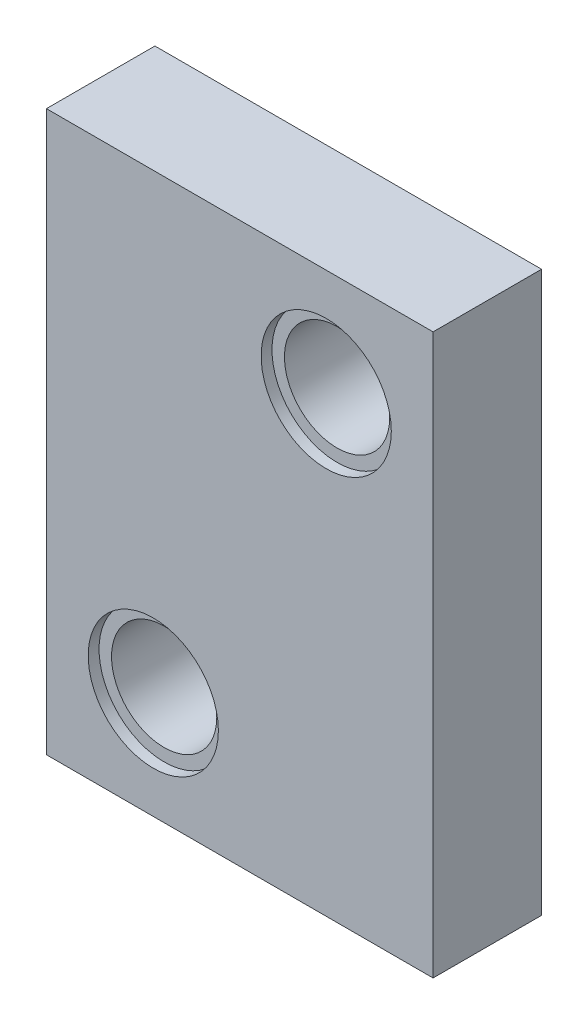
ISO-10303-21;
HEADER;
FILE_DESCRIPTION(('STEP AP214'),'2;1');
FILE_NAME('part.step','',(''),(''),'','','');
FILE_SCHEMA(('AUTOMOTIVE_DESIGN { 1 0 10303 214 1 1 1 1 }'));
ENDSEC;
DATA;
#1=APPLICATION_CONTEXT('core data for automotive mechanical design processes');
#2=APPLICATION_PROTOCOL_DEFINITION('international standard','automotive_design',2000,#1);
#3=PRODUCT_CONTEXT('',#1,'mechanical');
#4=PRODUCT('Part','Part','',(#3));
#5=PRODUCT_RELATED_PRODUCT_CATEGORY('part','',(#4));
#6=PRODUCT_DEFINITION_FORMATION('','',#4);
#7=PRODUCT_DEFINITION_CONTEXT('part definition',#1,'design');
#8=PRODUCT_DEFINITION('design','',#6,#7);
#9=PRODUCT_DEFINITION_SHAPE('','',#8);
#10=(LENGTH_UNIT() NAMED_UNIT(*) SI_UNIT(.MILLI.,.METRE.));
#11=(NAMED_UNIT(*) PLANE_ANGLE_UNIT() SI_UNIT($,.RADIAN.));
#12=(NAMED_UNIT(*) SI_UNIT($,.STERADIAN.) SOLID_ANGLE_UNIT());
#13=UNCERTAINTY_MEASURE_WITH_UNIT(LENGTH_MEASURE(1.E-05),#10,'distance_accuracy_value','');
#14=(GEOMETRIC_REPRESENTATION_CONTEXT(3) GLOBAL_UNCERTAINTY_ASSIGNED_CONTEXT((#13)) GLOBAL_UNIT_ASSIGNED_CONTEXT((#10,
#11,#12)) REPRESENTATION_CONTEXT('',''));
#15=CARTESIAN_POINT('',(0.,0.,0.));
#16=DIRECTION('',(0.,0.,1.));
#17=DIRECTION('',(1.,0.,0.));
#18=AXIS2_PLACEMENT_3D('',#15,#16,#17);
#19=CARTESIAN_POINT('',(12.895,20.865,-10.));
#20=DIRECTION('',(0.,0.,1.));
#21=DIRECTION('',(1.,0.,0.));
#22=AXIS2_PLACEMENT_3D('',#19,#20,#21);
#23=CYLINDRICAL_SURFACE('',#22,2.425);
#24=CARTESIAN_POINT('',(12.895,20.865,0.));
#25=DIRECTION('',(0.,0.,-1.));
#26=DIRECTION('',(-1.,0.,0.));
#27=AXIS2_PLACEMENT_3D('',#24,#25,#26);
#28=CIRCLE('',#27,2.425);
#29=CARTESIAN_POINT('',(10.47,20.865,0.));
#30=VERTEX_POINT('',#29);
#31=EDGE_CURVE('E109',#30,#30,#28,.T.);
#32=ORIENTED_EDGE('',*,*,#31,.T.);
#33=EDGE_LOOP('',(#32));
#34=FACE_BOUND('',#33,.T.);
#35=CARTESIAN_POINT('',(12.895,20.865,4.5));
#36=DIRECTION('',(0.,0.,1.));
#37=DIRECTION('',(1.,0.,0.));
#38=AXIS2_PLACEMENT_3D('',#35,#36,#37);
#39=CIRCLE('',#38,2.425);
#40=CARTESIAN_POINT('',(15.32,20.865,4.5));
#41=VERTEX_POINT('',#40);
#42=EDGE_CURVE('E37',#41,#41,#39,.F.);
#43=ORIENTED_EDGE('',*,*,#42,.F.);
#44=EDGE_LOOP('',(#43));
#45=FACE_BOUND('',#44,.T.);
#46=ADVANCED_FACE('F33',(#34,#45),#23,.F.);
#47=CARTESIAN_POINT('',(4.925,4.925,-10.));
#48=DIRECTION('',(0.,0.,1.));
#49=DIRECTION('',(1.,0.,0.));
#50=AXIS2_PLACEMENT_3D('',#47,#48,#49);
#51=CYLINDRICAL_SURFACE('',#50,2.425);
#52=CARTESIAN_POINT('',(4.925,4.925,0.));
#53=DIRECTION('',(0.,0.,-1.));
#54=DIRECTION('',(-1.,0.,0.));
#55=AXIS2_PLACEMENT_3D('',#52,#53,#54);
#56=CIRCLE('',#55,2.425);
#57=CARTESIAN_POINT('',(2.5,4.925,0.));
#58=VERTEX_POINT('',#57);
#59=EDGE_CURVE('E103',#58,#58,#56,.T.);
#60=ORIENTED_EDGE('',*,*,#59,.T.);
#61=EDGE_LOOP('',(#60));
#62=FACE_BOUND('',#61,.T.);
#63=CARTESIAN_POINT('',(4.925,4.925,4.5));
#64=DIRECTION('',(0.,0.,1.));
#65=DIRECTION('',(1.,0.,0.));
#66=AXIS2_PLACEMENT_3D('',#63,#64,#65);
#67=CIRCLE('',#66,2.425);
#68=CARTESIAN_POINT('',(7.35,4.925,4.5));
#69=VERTEX_POINT('',#68);
#70=EDGE_CURVE('E113',#69,#69,#67,.F.);
#71=ORIENTED_EDGE('',*,*,#70,.F.);
#72=EDGE_LOOP('',(#71));
#73=FACE_BOUND('',#72,.T.);
#74=ADVANCED_FACE('F152',(#62,#73),#51,.F.);
#75=CARTESIAN_POINT('',(0.,0.,5.));
#76=DIRECTION('',(1.,0.,0.));
#77=DIRECTION('',(0.,0.,-1.));
#78=AXIS2_PLACEMENT_3D('',#75,#76,#77);
#79=PLANE('',#78);
#80=DIRECTION('',(0.,-1.,0.));
#81=VECTOR('',#80,1.);
#82=CARTESIAN_POINT('',(0.,0.,0.));
#83=LINE('',#82,#81);
#84=CARTESIAN_POINT('',(0.,25.79,0.));
#85=VERTEX_POINT('',#84);
#86=CARTESIAN_POINT('',(0.,0.,0.));
#87=VERTEX_POINT('',#86);
#88=EDGE_CURVE('E100',#85,#87,#83,.T.);
#89=ORIENTED_EDGE('',*,*,#88,.T.);
#90=DIRECTION('',(0.,0.,-1.));
#91=VECTOR('',#90,1.);
#92=CARTESIAN_POINT('',(0.,0.,5.));
#93=LINE('',#92,#91);
#94=CARTESIAN_POINT('',(0.,0.,5.));
#95=VERTEX_POINT('',#94);
#96=EDGE_CURVE('E11',#95,#87,#93,.T.);
#97=ORIENTED_EDGE('',*,*,#96,.F.);
#98=DIRECTION('',(0.,-1.,0.));
#99=VECTOR('',#98,1.);
#100=CARTESIAN_POINT('',(0.,0.,5.));
#101=LINE('',#100,#99);
#102=CARTESIAN_POINT('',(0.,25.79,5.));
#103=VERTEX_POINT('',#102);
#104=EDGE_CURVE('E87',#103,#95,#101,.T.);
#105=ORIENTED_EDGE('',*,*,#104,.F.);
#106=DIRECTION('',(0.,0.,-1.));
#107=VECTOR('',#106,1.);
#108=CARTESIAN_POINT('',(0.,25.79,5.));
#109=LINE('',#108,#107);
#110=EDGE_CURVE('E96',#103,#85,#109,.T.);
#111=ORIENTED_EDGE('',*,*,#110,.T.);
#112=EDGE_LOOP('',(#89,#97,#105,#111));
#113=FACE_BOUND('',#112,.T.);
#114=ADVANCED_FACE('F35',(#113),#79,.F.);
#115=CARTESIAN_POINT('',(0.,0.,5.));
#116=DIRECTION('',(0.,1.,0.));
#117=DIRECTION('',(0.,0.,1.));
#118=AXIS2_PLACEMENT_3D('',#115,#116,#117);
#119=PLANE('',#118);
#120=DIRECTION('',(1.,0.,0.));
#121=VECTOR('',#120,1.);
#122=CARTESIAN_POINT('',(0.,0.,0.));
#123=LINE('',#122,#121);
#124=CARTESIAN_POINT('',(17.82,0.,0.));
#125=VERTEX_POINT('',#124);
#126=EDGE_CURVE('E91',#87,#125,#123,.T.);
#127=ORIENTED_EDGE('',*,*,#126,.T.);
#128=DIRECTION('',(0.,0.,-1.));
#129=VECTOR('',#128,1.);
#130=CARTESIAN_POINT('',(17.82,0.,5.));
#131=LINE('',#130,#129);
#132=CARTESIAN_POINT('',(17.82,0.,5.));
#133=VERTEX_POINT('',#132);
#134=EDGE_CURVE('E43',#133,#125,#131,.T.);
#135=ORIENTED_EDGE('',*,*,#134,.F.);
#136=DIRECTION('',(1.,0.,0.));
#137=VECTOR('',#136,1.);
#138=CARTESIAN_POINT('',(0.,0.,5.));
#139=LINE('',#138,#137);
#140=EDGE_CURVE('E82',#95,#133,#139,.T.);
#141=ORIENTED_EDGE('',*,*,#140,.F.);
#142=ORIENTED_EDGE('',*,*,#96,.T.);
#143=EDGE_LOOP('',(#127,#135,#141,#142));
#144=FACE_BOUND('',#143,.T.);
#145=ADVANCED_FACE('F90',(#144),#119,.F.);
#146=CARTESIAN_POINT('',(17.82,0.,5.));
#147=DIRECTION('',(-1.,0.,0.));
#148=DIRECTION('',(0.,0.,1.));
#149=AXIS2_PLACEMENT_3D('',#146,#147,#148);
#150=PLANE('',#149);
#151=DIRECTION('',(0.,1.,0.));
#152=VECTOR('',#151,1.);
#153=CARTESIAN_POINT('',(17.82,0.,0.));
#154=LINE('',#153,#152);
#155=CARTESIAN_POINT('',(17.82,25.79,0.));
#156=VERTEX_POINT('',#155);
#157=EDGE_CURVE('E69',#125,#156,#154,.T.);
#158=ORIENTED_EDGE('',*,*,#157,.T.);
#159=DIRECTION('',(0.,0.,-1.));
#160=VECTOR('',#159,1.);
#161=CARTESIAN_POINT('',(17.82,25.79,5.));
#162=LINE('',#161,#160);
#163=CARTESIAN_POINT('',(17.82,25.79,5.));
#164=VERTEX_POINT('',#163);
#165=EDGE_CURVE('E92',#164,#156,#162,.T.);
#166=ORIENTED_EDGE('',*,*,#165,.F.);
#167=DIRECTION('',(0.,1.,0.));
#168=VECTOR('',#167,1.);
#169=CARTESIAN_POINT('',(17.82,0.,5.));
#170=LINE('',#169,#168);
#171=EDGE_CURVE('E85',#133,#164,#170,.T.);
#172=ORIENTED_EDGE('',*,*,#171,.F.);
#173=ORIENTED_EDGE('',*,*,#134,.T.);
#174=EDGE_LOOP('',(#158,#166,#172,#173));
#175=FACE_BOUND('',#174,.T.);
#176=ADVANCED_FACE('F94',(#175),#150,.F.);
#177=CARTESIAN_POINT('',(0.,25.79,5.));
#178=DIRECTION('',(0.,-1.,0.));
#179=DIRECTION('',(0.,0.,-1.));
#180=AXIS2_PLACEMENT_3D('',#177,#178,#179);
#181=PLANE('',#180);
#182=DIRECTION('',(-1.,0.,0.));
#183=VECTOR('',#182,1.);
#184=CARTESIAN_POINT('',(0.,25.79,0.));
#185=LINE('',#184,#183);
#186=EDGE_CURVE('E75',#156,#85,#185,.T.);
#187=ORIENTED_EDGE('',*,*,#186,.T.);
#188=ORIENTED_EDGE('',*,*,#110,.F.);
#189=DIRECTION('',(-1.,0.,0.));
#190=VECTOR('',#189,1.);
#191=CARTESIAN_POINT('',(0.,25.79,5.));
#192=LINE('',#191,#190);
#193=EDGE_CURVE('E52',#164,#103,#192,.T.);
#194=ORIENTED_EDGE('',*,*,#193,.F.);
#195=ORIENTED_EDGE('',*,*,#165,.T.);
#196=EDGE_LOOP('',(#187,#188,#194,#195));
#197=FACE_BOUND('',#196,.T.);
#198=ADVANCED_FACE('F138',(#197),#181,.F.);
#199=CARTESIAN_POINT('',(0.,0.,5.));
#200=DIRECTION('',(0.,0.,-1.));
#201=DIRECTION('',(-1.,0.,0.));
#202=AXIS2_PLACEMENT_3D('',#199,#200,#201);
#203=PLANE('',#202);
#204=CARTESIAN_POINT('',(4.925,4.925,5.));
#205=DIRECTION('',(0.,0.,1.));
#206=DIRECTION('',(1.,0.,0.));
#207=AXIS2_PLACEMENT_3D('',#204,#205,#206);
#208=CIRCLE('',#207,3.);
#209=CARTESIAN_POINT('',(7.925,4.925,5.));
#210=VERTEX_POINT('',#209);
#211=EDGE_CURVE('E120',#210,#210,#208,.T.);
#212=ORIENTED_EDGE('',*,*,#211,.F.);
#213=EDGE_LOOP('',(#212));
#214=FACE_BOUND('',#213,.T.);
#215=CARTESIAN_POINT('',(12.895,20.865,5.));
#216=DIRECTION('',(0.,0.,1.));
#217=DIRECTION('',(1.,0.,0.));
#218=AXIS2_PLACEMENT_3D('',#215,#216,#217);
#219=CIRCLE('',#218,3.);
#220=CARTESIAN_POINT('',(15.895,20.865,5.));
#221=VERTEX_POINT('',#220);
#222=EDGE_CURVE('E130',#221,#221,#219,.T.);
#223=ORIENTED_EDGE('',*,*,#222,.F.);
#224=EDGE_LOOP('',(#223));
#225=FACE_BOUND('',#224,.T.);
#226=ORIENTED_EDGE('',*,*,#104,.T.);
#227=ORIENTED_EDGE('',*,*,#140,.T.);
#228=ORIENTED_EDGE('',*,*,#171,.T.);
#229=ORIENTED_EDGE('',*,*,#193,.T.);
#230=EDGE_LOOP('',(#226,#227,#228,#229));
#231=FACE_BOUND('',#230,.T.);
#232=ADVANCED_FACE('F83',(#214,#225,#231),#203,.F.);
#233=CARTESIAN_POINT('',(0.,0.,0.));
#234=DIRECTION('',(0.,0.,-1.));
#235=DIRECTION('',(-1.,0.,0.));
#236=AXIS2_PLACEMENT_3D('',#233,#234,#235);
#237=PLANE('',#236);
#238=ORIENTED_EDGE('',*,*,#59,.F.);
#239=EDGE_LOOP('',(#238));
#240=FACE_BOUND('',#239,.T.);
#241=ORIENTED_EDGE('',*,*,#31,.F.);
#242=EDGE_LOOP('',(#241));
#243=FACE_BOUND('',#242,.T.);
#244=ORIENTED_EDGE('',*,*,#88,.F.);
#245=ORIENTED_EDGE('',*,*,#186,.F.);
#246=ORIENTED_EDGE('',*,*,#157,.F.);
#247=ORIENTED_EDGE('',*,*,#126,.F.);
#248=EDGE_LOOP('',(#244,#245,#246,#247));
#249=FACE_BOUND('',#248,.T.);
#250=ADVANCED_FACE('F137',(#240,#243,#249),#237,.T.);
#251=CARTESIAN_POINT('',(4.925,4.925,4.5));
#252=DIRECTION('',(0.,0.,1.));
#253=DIRECTION('',(1.,0.,0.));
#254=AXIS2_PLACEMENT_3D('',#251,#252,#253);
#255=PLANE('',#254);
#256=CARTESIAN_POINT('',(4.925,4.925,4.5));
#257=DIRECTION('',(0.,0.,1.));
#258=DIRECTION('',(1.,0.,0.));
#259=AXIS2_PLACEMENT_3D('',#256,#257,#258);
#260=CIRCLE('',#259,3.);
#261=CARTESIAN_POINT('',(7.925,4.925,4.5));
#262=VERTEX_POINT('',#261);
#263=EDGE_CURVE('E115',#262,#262,#260,.T.);
#264=ORIENTED_EDGE('',*,*,#263,.T.);
#265=EDGE_LOOP('',(#264));
#266=FACE_BOUND('',#265,.T.);
#267=ORIENTED_EDGE('',*,*,#70,.T.);
#268=EDGE_LOOP('',(#267));
#269=FACE_BOUND('',#268,.T.);
#270=ADVANCED_FACE('F145',(#266,#269),#255,.T.);
#271=CARTESIAN_POINT('',(4.925,4.925,4.5));
#272=DIRECTION('',(0.,0.,1.));
#273=DIRECTION('',(1.,0.,0.));
#274=AXIS2_PLACEMENT_3D('',#271,#272,#273);
#275=CYLINDRICAL_SURFACE('',#274,3.);
#276=ORIENTED_EDGE('',*,*,#263,.F.);
#277=EDGE_LOOP('',(#276));
#278=FACE_BOUND('',#277,.T.);
#279=ORIENTED_EDGE('',*,*,#211,.T.);
#280=EDGE_LOOP('',(#279));
#281=FACE_BOUND('',#280,.T.);
#282=ADVANCED_FACE('F167',(#278,#281),#275,.F.);
#283=CARTESIAN_POINT('',(12.895,20.865,4.5));
#284=DIRECTION('',(0.,0.,1.));
#285=DIRECTION('',(1.,0.,0.));
#286=AXIS2_PLACEMENT_3D('',#283,#284,#285);
#287=PLANE('',#286);
#288=CARTESIAN_POINT('',(12.895,20.865,4.5));
#289=DIRECTION('',(0.,0.,1.));
#290=DIRECTION('',(1.,0.,0.));
#291=AXIS2_PLACEMENT_3D('',#288,#289,#290);
#292=CIRCLE('',#291,3.);
#293=CARTESIAN_POINT('',(15.895,20.865,4.5));
#294=VERTEX_POINT('',#293);
#295=EDGE_CURVE('E125',#294,#294,#292,.T.);
#296=ORIENTED_EDGE('',*,*,#295,.T.);
#297=EDGE_LOOP('',(#296));
#298=FACE_BOUND('',#297,.T.);
#299=ORIENTED_EDGE('',*,*,#42,.T.);
#300=EDGE_LOOP('',(#299));
#301=FACE_BOUND('',#300,.T.);
#302=ADVANCED_FACE('F163',(#298,#301),#287,.T.);
#303=CARTESIAN_POINT('',(12.895,20.865,4.5));
#304=DIRECTION('',(0.,0.,1.));
#305=DIRECTION('',(1.,0.,0.));
#306=AXIS2_PLACEMENT_3D('',#303,#304,#305);
#307=CYLINDRICAL_SURFACE('',#306,3.);
#308=ORIENTED_EDGE('',*,*,#295,.F.);
#309=EDGE_LOOP('',(#308));
#310=FACE_BOUND('',#309,.T.);
#311=ORIENTED_EDGE('',*,*,#222,.T.);
#312=EDGE_LOOP('',(#311));
#313=FACE_BOUND('',#312,.T.);
#314=ADVANCED_FACE('F134',(#310,#313),#307,.F.);
#315=CLOSED_SHELL('',(#46,#74,#114,#145,#176,#198,#232,#250,#270,#282,#302,#314));
#316=MANIFOLD_SOLID_BREP('B2',#315);
#317=ADVANCED_BREP_SHAPE_REPRESENTATION('',(#18,#316),#14);
#318=SHAPE_DEFINITION_REPRESENTATION(#9,#317);
ENDSEC;
END-ISO-10303-21;
